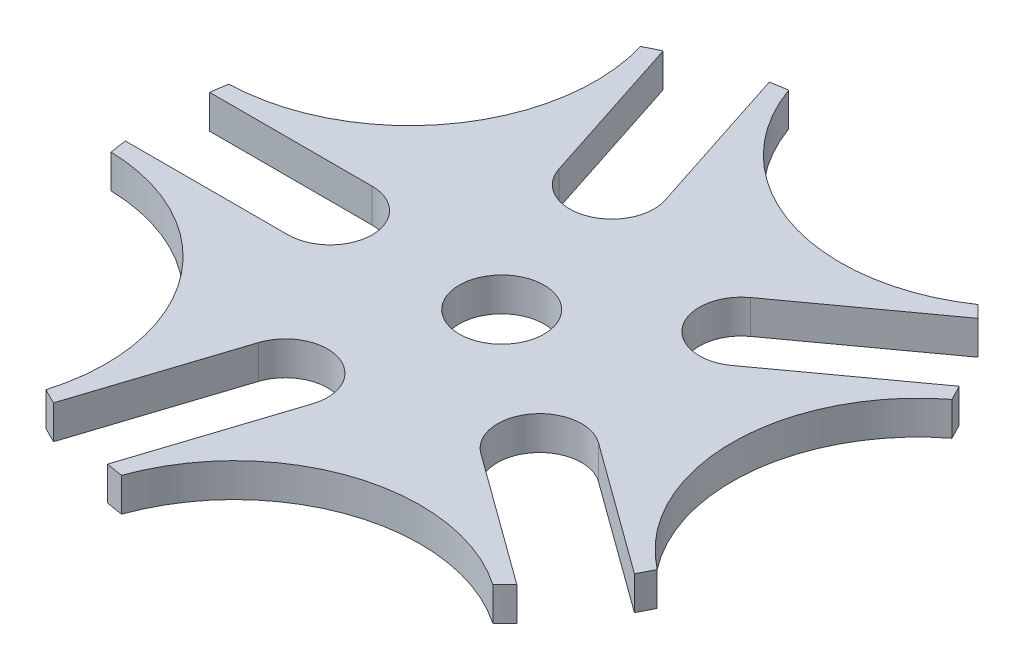
ISO-10303-21;
HEADER;
FILE_DESCRIPTION(('STEP AP214'),'2;1');
FILE_NAME('part.step','',(''),(''),'','','');
FILE_SCHEMA(('AUTOMOTIVE_DESIGN { 1 0 10303 214 1 1 1 1 }'));
ENDSEC;
DATA;
#1=APPLICATION_CONTEXT('core data for automotive mechanical design processes');
#2=APPLICATION_PROTOCOL_DEFINITION('international standard','automotive_design',2000,#1);
#3=PRODUCT_CONTEXT('',#1,'mechanical');
#4=PRODUCT('Part','Part','',(#3));
#5=PRODUCT_RELATED_PRODUCT_CATEGORY('part','',(#4));
#6=PRODUCT_DEFINITION_FORMATION('','',#4);
#7=PRODUCT_DEFINITION_CONTEXT('part definition',#1,'design');
#8=PRODUCT_DEFINITION('design','',#6,#7);
#9=PRODUCT_DEFINITION_SHAPE('','',#8);
#10=(LENGTH_UNIT() NAMED_UNIT(*) SI_UNIT(.MILLI.,.METRE.));
#11=(NAMED_UNIT(*) PLANE_ANGLE_UNIT() SI_UNIT($,.RADIAN.));
#12=(NAMED_UNIT(*) SI_UNIT($,.STERADIAN.) SOLID_ANGLE_UNIT());
#13=UNCERTAINTY_MEASURE_WITH_UNIT(LENGTH_MEASURE(1.E-05),#10,'distance_accuracy_value','');
#14=(GEOMETRIC_REPRESENTATION_CONTEXT(3) GLOBAL_UNCERTAINTY_ASSIGNED_CONTEXT((#13)) GLOBAL_UNIT_ASSIGNED_CONTEXT((#10,
#11,#12)) REPRESENTATION_CONTEXT('',''));
#15=CARTESIAN_POINT('',(0.,0.,0.));
#16=DIRECTION('',(0.,0.,1.));
#17=DIRECTION('',(1.,0.,0.));
#18=AXIS2_PLACEMENT_3D('',#15,#16,#17);
#19=CARTESIAN_POINT('',(0.,2.54,0.));
#20=DIRECTION('',(0.,-1.,0.));
#21=DIRECTION('',(0.,0.,-1.));
#22=AXIS2_PLACEMENT_3D('',#19,#20,#21);
#23=CYLINDRICAL_SURFACE('',#22,25.4);
#24=DIRECTION('',(0.,-1.,0.));
#25=VECTOR('',#24,1.);
#26=CARTESIAN_POINT('',(-11.9486583663731,5.08,-22.4140483457051));
#27=LINE('',#26,#25);
#28=CARTESIAN_POINT('',(-11.9486583663731,2.54,-22.4140483457051));
#29=VERTEX_POINT('',#28);
#30=CARTESIAN_POINT('',(-11.948658366374,0.,-22.4140483457068));
#31=VERTEX_POINT('',#30);
#32=EDGE_CURVE('E50',#29,#31,#27,.T.);
#33=ORIENTED_EDGE('',*,*,#32,.F.);
#34=CARTESIAN_POINT('',(0.,2.54,0.));
#35=DIRECTION('',(0.,1.,0.));
#36=DIRECTION('',(0.,0.,1.));
#37=AXIS2_PLACEMENT_3D('',#34,#35,#36);
#38=CIRCLE('',#37,25.4);
#39=CARTESIAN_POINT('',(-10.8070741132714,2.54,-22.9862382548833));
#40=VERTEX_POINT('',#39);
#41=EDGE_CURVE('E338',#40,#29,#38,.T.);
#42=ORIENTED_EDGE('',*,*,#41,.F.);
#43=DIRECTION('',(0.,-1.,0.));
#44=VECTOR('',#43,1.);
#45=CARTESIAN_POINT('',(-10.8070741132714,2.54,-22.9862382548833));
#46=LINE('',#45,#44);
#47=CARTESIAN_POINT('',(-10.8070741132714,0.,-22.9862382548833));
#48=VERTEX_POINT('',#47);
#49=EDGE_CURVE('E277',#48,#40,#46,.F.);
#50=ORIENTED_EDGE('',*,*,#49,.F.);
#51=CARTESIAN_POINT('',(0.,0.,0.));
#52=DIRECTION('',(0.,1.,0.));
#53=DIRECTION('',(0.,0.,1.));
#54=AXIS2_PLACEMENT_3D('',#51,#52,#53);
#55=CIRCLE('',#54,25.4);
#56=EDGE_CURVE('E257',#48,#31,#55,.T.);
#57=ORIENTED_EDGE('',*,*,#56,.T.);
#58=EDGE_LOOP('',(#33,#42,#50,#57));
#59=FACE_BOUND('',#58,.T.);
#60=ADVANCED_FACE('F37',(#59),#23,.T.);
#61=DIRECTION('',(0.,-1.,0.));
#62=VECTOR('',#61,1.);
#63=CARTESIAN_POINT('',(-25.0093652309289,5.08,-4.43752754875682));
#64=LINE('',#63,#62);
#65=CARTESIAN_POINT('',(-25.0093652309289,2.54,-4.43752754875682));
#66=VERTEX_POINT('',#65);
#67=CARTESIAN_POINT('',(-25.0093652309289,0.,-4.43752754875682));
#68=VERTEX_POINT('',#67);
#69=EDGE_CURVE('E299',#66,#68,#64,.T.);
#70=ORIENTED_EDGE('',*,*,#69,.T.);
#71=CARTESIAN_POINT('',(-25.2007812378906,0.,-3.17499999999725));
#72=VERTEX_POINT('',#71);
#73=EDGE_CURVE('E263',#68,#72,#55,.T.);
#74=ORIENTED_EDGE('',*,*,#73,.T.);
#75=DIRECTION('',(0.,-1.,0.));
#76=VECTOR('',#75,1.);
#77=CARTESIAN_POINT('',(-25.2007812378906,2.54,-3.17499999999725));
#78=LINE('',#77,#76);
#79=CARTESIAN_POINT('',(-25.2007812378906,2.54,-3.17499999999725));
#80=VERTEX_POINT('',#79);
#81=EDGE_CURVE('E298',#80,#72,#78,.T.);
#82=ORIENTED_EDGE('',*,*,#81,.F.);
#83=EDGE_CURVE('E345',#66,#80,#38,.T.);
#84=ORIENTED_EDGE('',*,*,#83,.F.);
#85=EDGE_LOOP('',(#70,#74,#82,#84));
#86=FACE_BOUND('',#85,.T.);
#87=ADVANCED_FACE('F296',(#86),#23,.T.);
#88=DIRECTION('',(0.,-1.,0.));
#89=VECTOR('',#88,1.);
#90=CARTESIAN_POINT('',(17.624688240549,5.08,-18.2901712518881));
#91=LINE('',#90,#89);
#92=CARTESIAN_POINT('',(17.624688240549,2.54,-18.2901712518881));
#93=VERTEX_POINT('',#92);
#94=CARTESIAN_POINT('',(17.6246882405498,0.,-18.290171251889));
#95=VERTEX_POINT('',#94);
#96=EDGE_CURVE('E237',#93,#95,#91,.T.);
#97=ORIENTED_EDGE('',*,*,#96,.F.);
#98=CARTESIAN_POINT('',(18.52164211695,2.54,-17.3812765150211));
#99=VERTEX_POINT('',#98);
#100=EDGE_CURVE('E350',#99,#93,#38,.T.);
#101=ORIENTED_EDGE('',*,*,#100,.F.);
#102=DIRECTION('',(0.,-1.,0.));
#103=VECTOR('',#102,1.);
#104=CARTESIAN_POINT('',(18.52164211695,2.54,-17.3812765150211));
#105=LINE('',#104,#103);
#106=CARTESIAN_POINT('',(18.52164211695,0.,-17.3812765150211));
#107=VERTEX_POINT('',#106);
#108=EDGE_CURVE('E392',#107,#99,#105,.F.);
#109=ORIENTED_EDGE('',*,*,#108,.F.);
#110=EDGE_CURVE('E256',#107,#95,#55,.T.);
#111=ORIENTED_EDGE('',*,*,#110,.T.);
#112=EDGE_LOOP('',(#97,#101,#109,#111));
#113=FACE_BOUND('',#112,.T.);
#114=ADVANCED_FACE('F502',(#113),#23,.T.);
#115=DIRECTION('',(0.,-1.,0.));
#116=VECTOR('',#115,1.);
#117=CARTESIAN_POINT('',(-3.50797938340129,5.08,-25.156591196853));
#118=LINE('',#117,#116);
#119=CARTESIAN_POINT('',(-3.50797938340129,2.54,-25.156591196853));
#120=VERTEX_POINT('',#119);
#121=CARTESIAN_POINT('',(-3.50797938340129,0.,-25.156591196853));
#122=VERTEX_POINT('',#121);
#123=EDGE_CURVE('E234',#120,#122,#118,.T.);
#124=ORIENTED_EDGE('',*,*,#123,.T.);
#125=CARTESIAN_POINT('',(-4.76786523479726,0.,-24.9484961691644));
#126=VERTEX_POINT('',#125);
#127=EDGE_CURVE('E248',#122,#126,#55,.T.);
#128=ORIENTED_EDGE('',*,*,#127,.T.);
#129=DIRECTION('',(0.,-1.,0.));
#130=VECTOR('',#129,1.);
#131=CARTESIAN_POINT('',(-4.76786523479726,2.54,-24.9484961691644));
#132=LINE('',#131,#130);
#133=CARTESIAN_POINT('',(-4.76786523479726,2.54,-24.9484961691644));
#134=VERTEX_POINT('',#133);
#135=EDGE_CURVE('E284',#134,#126,#132,.T.);
#136=ORIENTED_EDGE('',*,*,#135,.F.);
#137=EDGE_CURVE('E250',#120,#134,#38,.T.);
#138=ORIENTED_EDGE('',*,*,#137,.F.);
#139=EDGE_LOOP('',(#124,#128,#136,#138));
#140=FACE_BOUND('',#139,.T.);
#141=ADVANCED_FACE('F246',(#140),#23,.T.);
#142=DIRECTION('',(0.,-1.,0.));
#143=VECTOR('',#142,1.);
#144=CARTESIAN_POINT('',(-25.0093652309277,5.08,4.43752754876034));
#145=LINE('',#144,#143);
#146=CARTESIAN_POINT('',(-25.0093652309277,2.54,4.43752754876034));
#147=VERTEX_POINT('',#146);
#148=CARTESIAN_POINT('',(-25.0093652309288,0.,4.43752754876053));
#149=VERTEX_POINT('',#148);
#150=EDGE_CURVE('E58',#147,#149,#145,.T.);
#151=ORIENTED_EDGE('',*,*,#150,.F.);
#152=CARTESIAN_POINT('',(-25.2007812378899,2.54,3.17500000000277));
#153=VERTEX_POINT('',#152);
#154=EDGE_CURVE('E348',#153,#147,#38,.T.);
#155=ORIENTED_EDGE('',*,*,#154,.F.);
#156=DIRECTION('',(0.,-1.,0.));
#157=VECTOR('',#156,1.);
#158=CARTESIAN_POINT('',(-25.2007812378899,2.54,3.17500000000277));
#159=LINE('',#158,#157);
#160=CARTESIAN_POINT('',(-25.2007812378899,0.,3.17500000000277));
#161=VERTEX_POINT('',#160);
#162=EDGE_CURVE('E309',#161,#153,#159,.F.);
#163=ORIENTED_EDGE('',*,*,#162,.F.);
#164=EDGE_CURVE('E259',#161,#149,#55,.T.);
#165=ORIENTED_EDGE('',*,*,#164,.T.);
#166=EDGE_LOOP('',(#151,#155,#163,#165));
#167=FACE_BOUND('',#166,.T.);
#168=ADVANCED_FACE('F510',(#167),#23,.T.);
#169=DIRECTION('',(0.,-1.,0.));
#170=VECTOR('',#169,1.);
#171=CARTESIAN_POINT('',(-11.948658366372,5.08,22.4140483457086));
#172=LINE('',#171,#170);
#173=CARTESIAN_POINT('',(-11.948658366372,2.54,22.4140483457086));
#174=VERTEX_POINT('',#173);
#175=CARTESIAN_POINT('',(-11.948658366372,0.,22.4140483457086));
#176=VERTEX_POINT('',#175);
#177=EDGE_CURVE('E456',#174,#176,#172,.T.);
#178=ORIENTED_EDGE('',*,*,#177,.T.);
#179=CARTESIAN_POINT('',(-10.807074113268,0.,22.9862382548849));
#180=VERTEX_POINT('',#179);
#181=EDGE_CURVE('E268',#176,#180,#55,.T.);
#182=ORIENTED_EDGE('',*,*,#181,.T.);
#183=DIRECTION('',(0.,-1.,0.));
#184=VECTOR('',#183,1.);
#185=CARTESIAN_POINT('',(-10.807074113268,2.54,22.9862382548849));
#186=LINE('',#185,#184);
#187=CARTESIAN_POINT('',(-10.807074113268,2.54,22.9862382548849));
#188=VERTEX_POINT('',#187);
#189=EDGE_CURVE('E386',#188,#180,#186,.T.);
#190=ORIENTED_EDGE('',*,*,#189,.F.);
#191=EDGE_CURVE('E349',#174,#188,#38,.T.);
#192=ORIENTED_EDGE('',*,*,#191,.F.);
#193=EDGE_LOOP('',(#178,#182,#190,#192));
#194=FACE_BOUND('',#193,.T.);
#195=ADVANCED_FACE('F788',(#194),#23,.T.);
#196=DIRECTION('',(0.,-1.,0.));
#197=VECTOR('',#196,1.);
#198=CARTESIAN_POINT('',(-3.50797938339943,5.08,25.1565911968543));
#199=LINE('',#198,#197);
#200=CARTESIAN_POINT('',(-3.50797938339943,2.54,25.1565911968543));
#201=VERTEX_POINT('',#200);
#202=CARTESIAN_POINT('',(-3.50797938339942,0.,25.1565911968543));
#203=VERTEX_POINT('',#202);
#204=EDGE_CURVE('E461',#201,#203,#199,.T.);
#205=ORIENTED_EDGE('',*,*,#204,.F.);
#206=CARTESIAN_POINT('',(-4.76786523479357,2.54,24.9484961691651));
#207=VERTEX_POINT('',#206);
#208=EDGE_CURVE('E352',#207,#201,#38,.T.);
#209=ORIENTED_EDGE('',*,*,#208,.F.);
#210=DIRECTION('',(0.,-1.,0.));
#211=VECTOR('',#210,1.);
#212=CARTESIAN_POINT('',(-4.76786523479356,2.54,24.9484961691651));
#213=LINE('',#212,#211);
#214=CARTESIAN_POINT('',(-4.76786523479356,0.,24.9484961691651));
#215=VERTEX_POINT('',#214);
#216=EDGE_CURVE('E310',#215,#207,#213,.F.);
#217=ORIENTED_EDGE('',*,*,#216,.F.);
#218=EDGE_CURVE('E264',#215,#203,#55,.T.);
#219=ORIENTED_EDGE('',*,*,#218,.T.);
#220=EDGE_LOOP('',(#205,#209,#217,#219));
#221=FACE_BOUND('',#220,.T.);
#222=ADVANCED_FACE('F550',(#221),#23,.T.);
#223=DIRECTION('',(0.,-1.,0.));
#224=VECTOR('',#223,1.);
#225=CARTESIAN_POINT('',(17.6246882405508,5.08,18.2901712518894));
#226=LINE('',#225,#224);
#227=CARTESIAN_POINT('',(17.6246882405508,2.54,18.2901712518894));
#228=VERTEX_POINT('',#227);
#229=CARTESIAN_POINT('',(17.6246882405508,0.,18.2901712518894));
#230=VERTEX_POINT('',#229);
#231=EDGE_CURVE('E464',#228,#230,#226,.T.);
#232=ORIENTED_EDGE('',*,*,#231,.T.);
#233=CARTESIAN_POINT('',(18.5216421169506,0.,17.3812765150205));
#234=VERTEX_POINT('',#233);
#235=EDGE_CURVE('E269',#230,#234,#55,.T.);
#236=ORIENTED_EDGE('',*,*,#235,.T.);
#237=DIRECTION('',(0.,-1.,0.));
#238=VECTOR('',#237,1.);
#239=CARTESIAN_POINT('',(18.5216421169506,2.54,17.3812765150205));
#240=LINE('',#239,#238);
#241=CARTESIAN_POINT('',(18.5216421169506,2.54,17.3812765150205));
#242=VERTEX_POINT('',#241);
#243=EDGE_CURVE('E390',#242,#234,#240,.T.);
#244=ORIENTED_EDGE('',*,*,#243,.F.);
#245=EDGE_CURVE('E276',#228,#242,#38,.T.);
#246=ORIENTED_EDGE('',*,*,#245,.F.);
#247=EDGE_LOOP('',(#232,#236,#244,#246));
#248=FACE_BOUND('',#247,.T.);
#249=ADVANCED_FACE('F801',(#248),#23,.T.);
#250=DIRECTION('',(0.,-1.,0.));
#251=VECTOR('',#250,1.);
#252=CARTESIAN_POINT('',(22.8413147401536,5.08,11.1101008519834));
#253=LINE('',#252,#251);
#254=CARTESIAN_POINT('',(22.8413147401536,2.54,11.1101008519834));
#255=VERTEX_POINT('',#254);
#256=CARTESIAN_POINT('',(22.8413147401536,0.,11.1101008519834));
#257=VERTEX_POINT('',#256);
#258=EDGE_CURVE('E242',#255,#257,#253,.T.);
#259=ORIENTED_EDGE('',*,*,#258,.F.);
#260=CARTESIAN_POINT('',(22.2540784690076,2.54,12.2440186007394));
#261=VERTEX_POINT('',#260);
#262=EDGE_CURVE('E358',#261,#255,#38,.T.);
#263=ORIENTED_EDGE('',*,*,#262,.F.);
#264=DIRECTION('',(0.,-1.,0.));
#265=VECTOR('',#264,1.);
#266=CARTESIAN_POINT('',(22.2540784690076,2.54,12.2440186007394));
#267=LINE('',#266,#265);
#268=CARTESIAN_POINT('',(22.2540784690076,0.,12.2440186007394));
#269=VERTEX_POINT('',#268);
#270=EDGE_CURVE('E388',#269,#261,#267,.F.);
#271=ORIENTED_EDGE('',*,*,#270,.F.);
#272=EDGE_CURVE('E261',#269,#257,#55,.T.);
#273=ORIENTED_EDGE('',*,*,#272,.T.);
#274=EDGE_LOOP('',(#259,#263,#271,#273));
#275=FACE_BOUND('',#274,.T.);
#276=ADVANCED_FACE('F496',(#275),#23,.T.);
#277=DIRECTION('',(0.,-1.,0.));
#278=VECTOR('',#277,1.);
#279=CARTESIAN_POINT('',(22.8413147401536,5.08,-11.1101008519834));
#280=LINE('',#279,#278);
#281=CARTESIAN_POINT('',(22.8413147401536,2.54,-11.1101008519834));
#282=VERTEX_POINT('',#281);
#283=CARTESIAN_POINT('',(22.8413147401536,0.,-11.1101008519834));
#284=VERTEX_POINT('',#283);
#285=EDGE_CURVE('E469',#282,#284,#280,.T.);
#286=ORIENTED_EDGE('',*,*,#285,.T.);
#287=CARTESIAN_POINT('',(22.2540784690072,0.,-12.2440186007401));
#288=VERTEX_POINT('',#287);
#289=EDGE_CURVE('E260',#284,#288,#55,.T.);
#290=ORIENTED_EDGE('',*,*,#289,.T.);
#291=DIRECTION('',(0.,-1.,0.));
#292=VECTOR('',#291,1.);
#293=CARTESIAN_POINT('',(22.2540784690072,2.54,-12.2440186007401));
#294=LINE('',#293,#292);
#295=CARTESIAN_POINT('',(22.2540784690072,2.54,-12.2440186007401));
#296=VERTEX_POINT('',#295);
#297=EDGE_CURVE('E394',#296,#288,#294,.T.);
#298=ORIENTED_EDGE('',*,*,#297,.F.);
#299=EDGE_CURVE('E359',#282,#296,#38,.T.);
#300=ORIENTED_EDGE('',*,*,#299,.F.);
#301=EDGE_LOOP('',(#286,#290,#298,#300));
#302=FACE_BOUND('',#301,.T.);
#303=ADVANCED_FACE('F489',(#302),#23,.T.);
#304=CARTESIAN_POINT('',(0.,2.54,0.));
#305=DIRECTION('',(0.,1.,0.));
#306=DIRECTION('',(0.,0.,1.));
#307=AXIS2_PLACEMENT_3D('',#304,#305,#306);
#308=PLANE('',#307);
#309=CARTESIAN_POINT('',(0.,2.54,0.));
#310=DIRECTION('',(0.,1.,0.));
#311=DIRECTION('',(0.,0.,1.));
#312=AXIS2_PLACEMENT_3D('',#309,#310,#311);
#313=CIRCLE('',#312,3.2004);
#314=CARTESIAN_POINT('',(0.,2.54,3.2004));
#315=VERTEX_POINT('',#314);
#316=EDGE_CURVE('E475',#315,#315,#313,.T.);
#317=ORIENTED_EDGE('',*,*,#316,.F.);
#318=EDGE_LOOP('',(#317));
#319=FACE_BOUND('',#318,.T.);
#320=ORIENTED_EDGE('',*,*,#41,.T.);
#321=CARTESIAN_POINT('',(-25.3999999999996,2.54,-18.454180211334));
#322=DIRECTION('',(0.,1.,0.));
#323=DIRECTION('',(0.,0.,1.));
#324=AXIS2_PLACEMENT_3D('',#321,#322,#323);
#325=CIRCLE('',#324,14.0220949713707);
#326=EDGE_CURVE('E341',#29,#66,#325,.F.);
#327=ORIENTED_EDGE('',*,*,#326,.T.);
#328=ORIENTED_EDGE('',*,*,#83,.T.);
#329=DIRECTION('',(-1.,0.,0.));
#330=VECTOR('',#329,1.);
#331=CARTESIAN_POINT('',(-25.3999999999991,2.54,-3.17499999999725));
#332=LINE('',#331,#330);
#333=CARTESIAN_POINT('',(-12.9419464171576,2.54,-3.17499999999718));
#334=VERTEX_POINT('',#333);
#335=EDGE_CURVE('E308',#334,#80,#332,.T.);
#336=ORIENTED_EDGE('',*,*,#335,.F.);
#337=CARTESIAN_POINT('',(-12.9419464171576,2.54,2.82828573063649E-12));
#338=DIRECTION('',(0.,1.,0.));
#339=DIRECTION('',(0.,0.,1.));
#340=AXIS2_PLACEMENT_3D('',#337,#338,#339);
#341=CIRCLE('',#340,3.17500000000001);
#342=CARTESIAN_POINT('',(-12.9419464171577,2.54,3.17500000000284));
#343=VERTEX_POINT('',#342);
#344=EDGE_CURVE('E418',#343,#334,#341,.T.);
#345=ORIENTED_EDGE('',*,*,#344,.F.);
#346=DIRECTION('',(1.,0.,0.));
#347=VECTOR('',#346,1.);
#348=CARTESIAN_POINT('',(-25.3999999999991,2.54,3.17500000000277));
#349=LINE('',#348,#347);
#350=EDGE_CURVE('E415',#153,#343,#349,.T.);
#351=ORIENTED_EDGE('',*,*,#350,.F.);
#352=ORIENTED_EDGE('',*,*,#154,.T.);
#353=CARTESIAN_POINT('',(-25.3999999999984,2.54,18.4541802113375));
#354=DIRECTION('',(0.,1.,0.));
#355=DIRECTION('',(0.,0.,1.));
#356=AXIS2_PLACEMENT_3D('',#353,#354,#355);
#357=CIRCLE('',#356,14.0220949713707);
#358=EDGE_CURVE('E452',#147,#174,#357,.F.);
#359=ORIENTED_EDGE('',*,*,#358,.T.);
#360=ORIENTED_EDGE('',*,*,#191,.T.);
#361=DIRECTION('',(-0.309016994374953,0.,0.951056516295152));
#362=VECTOR('',#361,1.);
#363=CARTESIAN_POINT('',(-10.8686360963585,2.54,23.1757065567582));
#364=LINE('',#363,#362);
#365=CARTESIAN_POINT('',(-7.01888582242669,2.54,11.3273935164427));
#366=VERTEX_POINT('',#365);
#367=EDGE_CURVE('E430',#366,#188,#364,.T.);
#368=ORIENTED_EDGE('',*,*,#367,.F.);
#369=CARTESIAN_POINT('',(-3.99928138318958,2.54,12.3085224735831));
#370=DIRECTION('',(0.,1.,0.));
#371=DIRECTION('',(0.,0.,1.));
#372=AXIS2_PLACEMENT_3D('',#369,#370,#371);
#373=CIRCLE('',#372,3.17500000000001);
#374=CARTESIAN_POINT('',(-0.979676943952459,2.54,13.2896514307236));
#375=VERTEX_POINT('',#374);
#376=EDGE_CURVE('E428',#375,#366,#373,.T.);
#377=ORIENTED_EDGE('',*,*,#376,.F.);
#378=DIRECTION('',(0.309016994374953,0.,-0.951056516295152));
#379=VECTOR('',#378,1.);
#380=CARTESIAN_POINT('',(-4.82942721788424,2.54,25.1379644710391));
#381=LINE('',#380,#379);
#382=EDGE_CURVE('E425',#207,#375,#381,.T.);
#383=ORIENTED_EDGE('',*,*,#382,.F.);
#384=ORIENTED_EDGE('',*,*,#208,.T.);
#385=CARTESIAN_POINT('',(9.70193668575385,2.54,29.8594908164577));
#386=DIRECTION('',(0.,1.,0.));
#387=DIRECTION('',(0.,0.,1.));
#388=AXIS2_PLACEMENT_3D('',#385,#386,#387);
#389=CIRCLE('',#388,14.0220949713707);
#390=EDGE_CURVE('E450',#201,#228,#389,.F.);
#391=ORIENTED_EDGE('',*,*,#390,.T.);
#392=ORIENTED_EDGE('',*,*,#245,.T.);
#393=DIRECTION('',(0.809016994374944,0.,0.587785252292477));
#394=VECTOR('',#393,1.);
#395=CARTESIAN_POINT('',(18.6828134810969,2.54,17.4983743653694));
#396=LINE('',#395,#394);
#397=CARTESIAN_POINT('',(8.60403641574445,2.54,10.1757141971057));
#398=VERTEX_POINT('',#397);
#399=EDGE_CURVE('E440',#398,#242,#396,.T.);
#400=ORIENTED_EDGE('',*,*,#399,.F.);
#401=CARTESIAN_POINT('',(10.4702545917731,2.54,7.60708523996529));
#402=DIRECTION('',(0.,1.,0.));
#403=DIRECTION('',(0.,0.,1.));
#404=AXIS2_PLACEMENT_3D('',#401,#402,#403);
#405=CIRCLE('',#404,3.17500000000001);
#406=CARTESIAN_POINT('',(12.3364727678017,2.54,5.03845628282483));
#407=VERTEX_POINT('',#406);
#408=EDGE_CURVE('E438',#407,#398,#405,.T.);
#409=ORIENTED_EDGE('',*,*,#408,.F.);
#410=DIRECTION('',(-0.809016994374944,0.,-0.587785252292478));
#411=VECTOR('',#410,1.);
#412=CARTESIAN_POINT('',(22.4152498331541,2.54,12.3611164510885));
#413=LINE('',#412,#411);
#414=EDGE_CURVE('E408',#261,#407,#413,.T.);
#415=ORIENTED_EDGE('',*,*,#414,.F.);
#416=ORIENTED_EDGE('',*,*,#262,.T.);
#417=CARTESIAN_POINT('',(31.3961266284945,2.54,0.));
#418=DIRECTION('',(0.,1.,0.));
#419=DIRECTION('',(0.,0.,1.));
#420=AXIS2_PLACEMENT_3D('',#417,#418,#419);
#421=CIRCLE('',#420,14.0220949713707);
#422=EDGE_CURVE('E448',#255,#282,#421,.F.);
#423=ORIENTED_EDGE('',*,*,#422,.T.);
#424=ORIENTED_EDGE('',*,*,#299,.T.);
#425=DIRECTION('',(0.809016994374951,0.,-0.587785252292469));
#426=VECTOR('',#425,1.);
#427=CARTESIAN_POINT('',(22.4152498331523,2.54,-12.3611164510882));
#428=LINE('',#427,#426);
#429=CARTESIAN_POINT('',(12.3364727677999,2.54,-5.03845628282468));
#430=VERTEX_POINT('',#429);
#431=EDGE_CURVE('E402',#430,#296,#428,.T.);
#432=ORIENTED_EDGE('',*,*,#431,.F.);
#433=CARTESIAN_POINT('',(10.4702545917713,2.54,-7.60708523996515));
#434=DIRECTION('',(0.,1.,0.));
#435=DIRECTION('',(0.,0.,1.));
#436=AXIS2_PLACEMENT_3D('',#433,#434,#435);
#437=CIRCLE('',#436,3.17500000000001);
#438=CARTESIAN_POINT('',(8.60403641574269,2.54,-10.1757141971056));
#439=VERTEX_POINT('',#438);
#440=EDGE_CURVE('E404',#439,#430,#437,.T.);
#441=ORIENTED_EDGE('',*,*,#440,.F.);
#442=DIRECTION('',(-0.809016994374951,0.,0.587785252292468));
#443=VECTOR('',#442,1.);
#444=CARTESIAN_POINT('',(18.6828134810952,2.54,-17.4983743653692));
#445=LINE('',#444,#443);
#446=EDGE_CURVE('E406',#99,#439,#445,.T.);
#447=ORIENTED_EDGE('',*,*,#446,.F.);
#448=ORIENTED_EDGE('',*,*,#100,.T.);
#449=CARTESIAN_POINT('',(9.701936685752,2.54,-29.8594908164563));
#450=DIRECTION('',(0.,1.,0.));
#451=DIRECTION('',(0.,0.,1.));
#452=AXIS2_PLACEMENT_3D('',#449,#450,#451);
#453=CIRCLE('',#452,14.0220949713707);
#454=EDGE_CURVE('E346',#93,#120,#453,.F.);
#455=ORIENTED_EDGE('',*,*,#454,.T.);
#456=ORIENTED_EDGE('',*,*,#137,.T.);
#457=DIRECTION('',(-0.309016994374943,0.,-0.951056516295155));
#458=VECTOR('',#457,1.);
#459=CARTESIAN_POINT('',(-4.829427217887,2.54,-25.1379644710356));
#460=LINE('',#459,#458);
#461=CARTESIAN_POINT('',(-0.979676943955354,2.54,-13.28965143072));
#462=VERTEX_POINT('',#461);
#463=EDGE_CURVE('E374',#462,#134,#460,.T.);
#464=ORIENTED_EDGE('',*,*,#463,.F.);
#465=CARTESIAN_POINT('',(-3.99928138319248,2.54,-12.3085224735796));
#466=DIRECTION('',(0.,1.,0.));
#467=DIRECTION('',(0.,0.,1.));
#468=AXIS2_PLACEMENT_3D('',#465,#466,#467);
#469=CIRCLE('',#468,3.17500000000001);
#470=CARTESIAN_POINT('',(-7.01888582242961,2.54,-11.3273935164392));
#471=VERTEX_POINT('',#470);
#472=EDGE_CURVE('E380',#471,#462,#469,.T.);
#473=ORIENTED_EDGE('',*,*,#472,.F.);
#474=DIRECTION('',(0.309016994374942,0.,0.951056516295156));
#475=VECTOR('',#474,1.);
#476=CARTESIAN_POINT('',(-10.8686360963612,2.54,-23.1757065567547));
#477=LINE('',#476,#475);
#478=EDGE_CURVE('E409',#40,#471,#477,.T.);
#479=ORIENTED_EDGE('',*,*,#478,.F.);
#480=EDGE_LOOP('',(#320,#327,#328,#336,#345,#351,#352,#359,#360,#368,#377,#383,#384,#391,#392,
#400,#409,#415,#416,#423,#424,#432,#441,#447,#448,#455,#456,#464,#473,#479));
#481=FACE_BOUND('',#480,.T.);
#482=ADVANCED_FACE('F344',(#319,#481),#308,.T.);
#483=CARTESIAN_POINT('',(0.,0.,0.));
#484=DIRECTION('',(0.,1.,0.));
#485=DIRECTION('',(0.,0.,1.));
#486=AXIS2_PLACEMENT_3D('',#483,#484,#485);
#487=PLANE('',#486);
#488=CARTESIAN_POINT('',(0.,0.,0.));
#489=DIRECTION('',(0.,1.,0.));
#490=DIRECTION('',(0.,0.,1.));
#491=AXIS2_PLACEMENT_3D('',#488,#489,#490);
#492=CIRCLE('',#491,3.2004);
#493=CARTESIAN_POINT('',(0.,0.,3.2004));
#494=VERTEX_POINT('',#493);
#495=EDGE_CURVE('E460',#494,#494,#492,.T.);
#496=ORIENTED_EDGE('',*,*,#495,.T.);
#497=EDGE_LOOP('',(#496));
#498=FACE_BOUND('',#497,.T.);
#499=CARTESIAN_POINT('',(-25.3999999999996,0.,-18.454180211334));
#500=DIRECTION('',(0.,1.,0.));
#501=DIRECTION('',(0.,0.,1.));
#502=AXIS2_PLACEMENT_3D('',#499,#500,#501);
#503=CIRCLE('',#502,14.0220949713707);
#504=EDGE_CURVE('E11',#31,#68,#503,.F.);
#505=ORIENTED_EDGE('',*,*,#504,.F.);
#506=ORIENTED_EDGE('',*,*,#56,.F.);
#507=DIRECTION('',(-0.309016994374942,0.,-0.951056516295155));
#508=VECTOR('',#507,1.);
#509=CARTESIAN_POINT('',(-3.01960443923819,0.,0.981128957140789));
#510=LINE('',#509,#508);
#511=CARTESIAN_POINT('',(-7.01888582242961,0.,-11.3273935164392));
#512=VERTEX_POINT('',#511);
#513=EDGE_CURVE('E44',#512,#48,#510,.T.);
#514=ORIENTED_EDGE('',*,*,#513,.F.);
#515=CARTESIAN_POINT('',(-3.99928138319248,0.,-12.3085224735796));
#516=DIRECTION('',(0.,1.,0.));
#517=DIRECTION('',(0.,0.,1.));
#518=AXIS2_PLACEMENT_3D('',#515,#516,#517);
#519=CIRCLE('',#518,3.17500000000001);
#520=CARTESIAN_POINT('',(-0.979676943955354,0.,-13.28965143072));
#521=VERTEX_POINT('',#520);
#522=EDGE_CURVE('E325',#521,#512,#519,.F.);
#523=ORIENTED_EDGE('',*,*,#522,.F.);
#524=DIRECTION('',(0.309016994374943,0.,0.951056516295155));
#525=VECTOR('',#524,1.);
#526=CARTESIAN_POINT('',(3.01960443923607,0.,-0.981128957140102));
#527=LINE('',#526,#525);
#528=EDGE_CURVE('E255',#126,#521,#527,.T.);
#529=ORIENTED_EDGE('',*,*,#528,.F.);
#530=ORIENTED_EDGE('',*,*,#127,.F.);
#531=CARTESIAN_POINT('',(9.701936685752,0.,-29.8594908164563));
#532=DIRECTION('',(0.,1.,0.));
#533=DIRECTION('',(0.,0.,1.));
#534=AXIS2_PLACEMENT_3D('',#531,#532,#533);
#535=CIRCLE('',#534,14.0220949713707);
#536=EDGE_CURVE('E231',#122,#95,#535,.T.);
#537=ORIENTED_EDGE('',*,*,#536,.T.);
#538=ORIENTED_EDGE('',*,*,#110,.F.);
#539=DIRECTION('',(0.809016994374951,0.,-0.587785252292468));
#540=VECTOR('',#539,1.);
#541=CARTESIAN_POINT('',(-1.86621817602859,0.,-2.56862895714047));
#542=LINE('',#541,#540);
#543=CARTESIAN_POINT('',(8.60403641574269,0.,-10.1757141971056));
#544=VERTEX_POINT('',#543);
#545=EDGE_CURVE('E524',#544,#107,#542,.T.);
#546=ORIENTED_EDGE('',*,*,#545,.F.);
#547=CARTESIAN_POINT('',(10.4702545917713,0.,-7.60708523996515));
#548=DIRECTION('',(0.,1.,0.));
#549=DIRECTION('',(0.,0.,1.));
#550=AXIS2_PLACEMENT_3D('',#547,#548,#549);
#551=CIRCLE('',#550,3.17500000000001);
#552=CARTESIAN_POINT('',(12.3364727677999,0.,-5.03845628282468));
#553=VERTEX_POINT('',#552);
#554=EDGE_CURVE('E522',#553,#544,#551,.F.);
#555=ORIENTED_EDGE('',*,*,#554,.F.);
#556=DIRECTION('',(-0.809016994374951,0.,0.587785252292469));
#557=VECTOR('',#556,1.);
#558=CARTESIAN_POINT('',(1.8662181760286,0.,2.56862895714048));
#559=LINE('',#558,#557);
#560=EDGE_CURVE('E369',#288,#553,#559,.T.);
#561=ORIENTED_EDGE('',*,*,#560,.F.);
#562=ORIENTED_EDGE('',*,*,#289,.F.);
#563=CARTESIAN_POINT('',(31.3961266284945,0.,0.));
#564=DIRECTION('',(0.,1.,0.));
#565=DIRECTION('',(0.,0.,1.));
#566=AXIS2_PLACEMENT_3D('',#563,#564,#565);
#567=CIRCLE('',#566,14.0220949713707);
#568=EDGE_CURVE('E463',#284,#257,#567,.T.);
#569=ORIENTED_EDGE('',*,*,#568,.T.);
#570=ORIENTED_EDGE('',*,*,#272,.F.);
#571=DIRECTION('',(0.809016994374944,0.,0.587785252292478));
#572=VECTOR('',#571,1.);
#573=CARTESIAN_POINT('',(1.86621817602927,0.,-2.56862895714134));
#574=LINE('',#573,#572);
#575=CARTESIAN_POINT('',(12.3364727678017,0.,5.03845628282483));
#576=VERTEX_POINT('',#575);
#577=EDGE_CURVE('E532',#576,#269,#574,.T.);
#578=ORIENTED_EDGE('',*,*,#577,.F.);
#579=CARTESIAN_POINT('',(10.4702545917731,0.,7.60708523996529));
#580=DIRECTION('',(0.,1.,0.));
#581=DIRECTION('',(0.,0.,1.));
#582=AXIS2_PLACEMENT_3D('',#579,#580,#581);
#583=CIRCLE('',#582,3.17500000000001);
#584=CARTESIAN_POINT('',(8.60403641574445,0.,10.1757141971057));
#585=VERTEX_POINT('',#584);
#586=EDGE_CURVE('E530',#585,#576,#583,.F.);
#587=ORIENTED_EDGE('',*,*,#586,.F.);
#588=DIRECTION('',(-0.809016994374944,0.,-0.587785252292477));
#589=VECTOR('',#588,1.);
#590=CARTESIAN_POINT('',(-1.86621817602798,0.,2.56862895713957));
#591=LINE('',#590,#589);
#592=EDGE_CURVE('E526',#234,#585,#591,.T.);
#593=ORIENTED_EDGE('',*,*,#592,.F.);
#594=ORIENTED_EDGE('',*,*,#235,.F.);
#595=CARTESIAN_POINT('',(9.70193668575385,0.,29.8594908164577));
#596=DIRECTION('',(0.,1.,0.));
#597=DIRECTION('',(0.,0.,1.));
#598=AXIS2_PLACEMENT_3D('',#595,#596,#597);
#599=CIRCLE('',#598,14.0220949713707);
#600=EDGE_CURVE('E455',#230,#203,#599,.T.);
#601=ORIENTED_EDGE('',*,*,#600,.T.);
#602=ORIENTED_EDGE('',*,*,#218,.F.);
#603=DIRECTION('',(-0.309016994374953,0.,0.951056516295152));
#604=VECTOR('',#603,1.);
#605=CARTESIAN_POINT('',(3.01960443923986,0.,0.98112895714137));
#606=LINE('',#605,#604);
#607=CARTESIAN_POINT('',(-0.979676943952459,0.,13.2896514307236));
#608=VERTEX_POINT('',#607);
#609=EDGE_CURVE('E315',#608,#215,#606,.T.);
#610=ORIENTED_EDGE('',*,*,#609,.F.);
#611=CARTESIAN_POINT('',(-3.99928138318958,0.,12.3085224735831));
#612=DIRECTION('',(0.,1.,0.));
#613=DIRECTION('',(0.,0.,1.));
#614=AXIS2_PLACEMENT_3D('',#611,#612,#613);
#615=CIRCLE('',#614,3.17500000000001);
#616=CARTESIAN_POINT('',(-7.01888582242669,0.,11.3273935164427));
#617=VERTEX_POINT('',#616);
#618=EDGE_CURVE('E319',#617,#608,#615,.F.);
#619=ORIENTED_EDGE('',*,*,#618,.F.);
#620=DIRECTION('',(0.309016994374953,0.,-0.951056516295152));
#621=VECTOR('',#620,1.);
#622=CARTESIAN_POINT('',(-3.01960443923437,0.,-0.981128957139584));
#623=LINE('',#622,#621);
#624=EDGE_CURVE('E534',#180,#617,#623,.T.);
#625=ORIENTED_EDGE('',*,*,#624,.F.);
#626=ORIENTED_EDGE('',*,*,#181,.F.);
#627=CARTESIAN_POINT('',(-25.3999999999984,0.,18.4541802113375));
#628=DIRECTION('',(0.,1.,0.));
#629=DIRECTION('',(0.,0.,1.));
#630=AXIS2_PLACEMENT_3D('',#627,#628,#629);
#631=CIRCLE('',#630,14.0220949713707);
#632=EDGE_CURVE('E458',#176,#149,#631,.T.);
#633=ORIENTED_EDGE('',*,*,#632,.T.);
#634=ORIENTED_EDGE('',*,*,#164,.F.);
#635=DIRECTION('',(-1.,0.,0.));
#636=VECTOR('',#635,1.);
#637=CARTESIAN_POINT('',(0.,0.,3.17500000000291));
#638=LINE('',#637,#636);
#639=CARTESIAN_POINT('',(-12.9419464171577,0.,3.17500000000284));
#640=VERTEX_POINT('',#639);
#641=EDGE_CURVE('E317',#640,#161,#638,.T.);
#642=ORIENTED_EDGE('',*,*,#641,.F.);
#643=CARTESIAN_POINT('',(-12.9419464171576,0.,2.82828573063649E-12));
#644=DIRECTION('',(0.,1.,0.));
#645=DIRECTION('',(0.,0.,1.));
#646=AXIS2_PLACEMENT_3D('',#643,#644,#645);
#647=CIRCLE('',#646,3.17500000000001);
#648=CARTESIAN_POINT('',(-12.9419464171576,0.,-3.17499999999718));
#649=VERTEX_POINT('',#648);
#650=EDGE_CURVE('E314',#649,#640,#647,.F.);
#651=ORIENTED_EDGE('',*,*,#650,.F.);
#652=DIRECTION('',(1.,0.,0.));
#653=VECTOR('',#652,1.);
#654=CARTESIAN_POINT('',(0.,0.,-3.17499999999711));
#655=LINE('',#654,#653);
#656=EDGE_CURVE('E305',#72,#649,#655,.T.);
#657=ORIENTED_EDGE('',*,*,#656,.F.);
#658=ORIENTED_EDGE('',*,*,#73,.F.);
#659=EDGE_LOOP('',(#505,#506,#514,#523,#529,#530,#537,#538,#546,#555,#561,#562,#569,#570,#578,
#587,#593,#594,#601,#602,#610,#619,#625,#626,#633,#634,#642,#651,#657,#658));
#660=FACE_BOUND('',#659,.T.);
#661=ADVANCED_FACE('F253',(#498,#660),#487,.F.);
#662=CARTESIAN_POINT('',(18.6828134810952,2.54,-17.4983743653692));
#663=DIRECTION('',(0.587785252292468,0.,0.809016994374951));
#664=DIRECTION('',(0.809016994374951,0.,-0.587785252292468));
#665=AXIS2_PLACEMENT_3D('',#662,#663,#664);
#666=PLANE('',#665);
#667=ORIENTED_EDGE('',*,*,#108,.T.);
#668=ORIENTED_EDGE('',*,*,#446,.T.);
#669=DIRECTION('',(0.,-1.,0.));
#670=VECTOR('',#669,1.);
#671=CARTESIAN_POINT('',(8.60403641574269,2.54,-10.1757141971056));
#672=LINE('',#671,#670);
#673=EDGE_CURVE('E396',#439,#544,#672,.T.);
#674=ORIENTED_EDGE('',*,*,#673,.T.);
#675=ORIENTED_EDGE('',*,*,#545,.T.);
#676=EDGE_LOOP('',(#667,#668,#674,#675));
#677=FACE_BOUND('',#676,.T.);
#678=ADVANCED_FACE('F495',(#677),#666,.T.);
#679=CARTESIAN_POINT('',(10.4702545917713,2.54,-7.60708523996515));
#680=DIRECTION('',(0.,-1.,0.));
#681=DIRECTION('',(0.,0.,-1.));
#682=AXIS2_PLACEMENT_3D('',#679,#680,#681);
#683=CYLINDRICAL_SURFACE('',#682,3.17500000000001);
#684=ORIENTED_EDGE('',*,*,#554,.T.);
#685=ORIENTED_EDGE('',*,*,#673,.F.);
#686=ORIENTED_EDGE('',*,*,#440,.T.);
#687=DIRECTION('',(0.,-1.,0.));
#688=VECTOR('',#687,1.);
#689=CARTESIAN_POINT('',(12.3364727677999,2.54,-5.03845628282468));
#690=LINE('',#689,#688);
#691=EDGE_CURVE('E399',#430,#553,#690,.T.);
#692=ORIENTED_EDGE('',*,*,#691,.T.);
#693=EDGE_LOOP('',(#684,#685,#686,#692));
#694=FACE_BOUND('',#693,.T.);
#695=ADVANCED_FACE('F519',(#694),#683,.F.);
#696=CARTESIAN_POINT('',(22.4152498331523,2.54,-12.3611164510882));
#697=DIRECTION('',(-0.587785252292469,0.,-0.809016994374951));
#698=DIRECTION('',(-0.809016994374951,0.,0.587785252292469));
#699=AXIS2_PLACEMENT_3D('',#696,#697,#698);
#700=PLANE('',#699);
#701=ORIENTED_EDGE('',*,*,#297,.T.);
#702=ORIENTED_EDGE('',*,*,#560,.T.);
#703=ORIENTED_EDGE('',*,*,#691,.F.);
#704=ORIENTED_EDGE('',*,*,#431,.T.);
#705=EDGE_LOOP('',(#701,#702,#703,#704));
#706=FACE_BOUND('',#705,.T.);
#707=ADVANCED_FACE('F584',(#706),#700,.T.);
#708=CARTESIAN_POINT('',(22.4152498331541,2.54,12.3611164510885));
#709=DIRECTION('',(-0.587785252292478,0.,0.809016994374944));
#710=DIRECTION('',(0.809016994374944,0.,0.587785252292478));
#711=AXIS2_PLACEMENT_3D('',#708,#709,#710);
#712=PLANE('',#711);
#713=ORIENTED_EDGE('',*,*,#270,.T.);
#714=ORIENTED_EDGE('',*,*,#414,.T.);
#715=DIRECTION('',(0.,-1.,0.));
#716=VECTOR('',#715,1.);
#717=CARTESIAN_POINT('',(12.3364727678017,2.54,5.03845628282483));
#718=LINE('',#717,#716);
#719=EDGE_CURVE('E427',#407,#576,#718,.T.);
#720=ORIENTED_EDGE('',*,*,#719,.T.);
#721=ORIENTED_EDGE('',*,*,#577,.T.);
#722=EDGE_LOOP('',(#713,#714,#720,#721));
#723=FACE_BOUND('',#722,.T.);
#724=ADVANCED_FACE('F587',(#723),#712,.T.);
#725=CARTESIAN_POINT('',(10.4702545917731,2.54,7.60708523996529));
#726=DIRECTION('',(0.,-1.,0.));
#727=DIRECTION('',(0.,0.,-1.));
#728=AXIS2_PLACEMENT_3D('',#725,#726,#727);
#729=CYLINDRICAL_SURFACE('',#728,3.17500000000001);
#730=ORIENTED_EDGE('',*,*,#586,.T.);
#731=ORIENTED_EDGE('',*,*,#719,.F.);
#732=ORIENTED_EDGE('',*,*,#408,.T.);
#733=DIRECTION('',(0.,-1.,0.));
#734=VECTOR('',#733,1.);
#735=CARTESIAN_POINT('',(8.60403641574445,2.54,10.1757141971057));
#736=LINE('',#735,#734);
#737=EDGE_CURVE('E442',#398,#585,#736,.T.);
#738=ORIENTED_EDGE('',*,*,#737,.T.);
#739=EDGE_LOOP('',(#730,#731,#732,#738));
#740=FACE_BOUND('',#739,.T.);
#741=ADVANCED_FACE('F613',(#740),#729,.F.);
#742=CARTESIAN_POINT('',(18.6828134810969,2.54,17.4983743653694));
#743=DIRECTION('',(0.587785252292477,0.,-0.809016994374944));
#744=DIRECTION('',(-0.809016994374944,0.,-0.587785252292477));
#745=AXIS2_PLACEMENT_3D('',#742,#743,#744);
#746=PLANE('',#745);
#747=ORIENTED_EDGE('',*,*,#243,.T.);
#748=ORIENTED_EDGE('',*,*,#592,.T.);
#749=ORIENTED_EDGE('',*,*,#737,.F.);
#750=ORIENTED_EDGE('',*,*,#399,.T.);
#751=EDGE_LOOP('',(#747,#748,#749,#750));
#752=FACE_BOUND('',#751,.T.);
#753=ADVANCED_FACE('F622',(#752),#746,.T.);
#754=CARTESIAN_POINT('',(-4.82942721788424,2.54,25.1379644710391));
#755=DIRECTION('',(-0.951056516295152,0.,-0.309016994374953));
#756=DIRECTION('',(-0.309016994374953,0.,0.951056516295152));
#757=AXIS2_PLACEMENT_3D('',#754,#755,#756);
#758=PLANE('',#757);
#759=ORIENTED_EDGE('',*,*,#216,.T.);
#760=ORIENTED_EDGE('',*,*,#382,.T.);
#761=DIRECTION('',(0.,-1.,0.));
#762=VECTOR('',#761,1.);
#763=CARTESIAN_POINT('',(-0.979676943952459,2.54,13.2896514307236));
#764=LINE('',#763,#762);
#765=EDGE_CURVE('E417',#375,#608,#764,.T.);
#766=ORIENTED_EDGE('',*,*,#765,.T.);
#767=ORIENTED_EDGE('',*,*,#609,.T.);
#768=EDGE_LOOP('',(#759,#760,#766,#767));
#769=FACE_BOUND('',#768,.T.);
#770=ADVANCED_FACE('F544',(#769),#758,.T.);
#771=CARTESIAN_POINT('',(-3.99928138318958,2.54,12.3085224735831));
#772=DIRECTION('',(0.,-1.,0.));
#773=DIRECTION('',(0.,0.,-1.));
#774=AXIS2_PLACEMENT_3D('',#771,#772,#773);
#775=CYLINDRICAL_SURFACE('',#774,3.17500000000001);
#776=ORIENTED_EDGE('',*,*,#618,.T.);
#777=ORIENTED_EDGE('',*,*,#765,.F.);
#778=ORIENTED_EDGE('',*,*,#376,.T.);
#779=DIRECTION('',(0.,-1.,0.));
#780=VECTOR('',#779,1.);
#781=CARTESIAN_POINT('',(-7.01888582242669,2.54,11.3273935164427));
#782=LINE('',#781,#780);
#783=EDGE_CURVE('E432',#366,#617,#782,.T.);
#784=ORIENTED_EDGE('',*,*,#783,.T.);
#785=EDGE_LOOP('',(#776,#777,#778,#784));
#786=FACE_BOUND('',#785,.T.);
#787=ADVANCED_FACE('F538',(#786),#775,.F.);
#788=CARTESIAN_POINT('',(-10.8686360963585,2.54,23.1757065567582));
#789=DIRECTION('',(0.951056516295152,0.,0.309016994374952));
#790=DIRECTION('',(0.309016994374953,0.,-0.951056516295152));
#791=AXIS2_PLACEMENT_3D('',#788,#789,#790);
#792=PLANE('',#791);
#793=ORIENTED_EDGE('',*,*,#189,.T.);
#794=ORIENTED_EDGE('',*,*,#624,.T.);
#795=ORIENTED_EDGE('',*,*,#783,.F.);
#796=ORIENTED_EDGE('',*,*,#367,.T.);
#797=EDGE_LOOP('',(#793,#794,#795,#796));
#798=FACE_BOUND('',#797,.T.);
#799=ADVANCED_FACE('F553',(#798),#792,.T.);
#800=CARTESIAN_POINT('',(-25.3999999999991,2.54,3.17500000000277));
#801=DIRECTION('',(0.,0.,-1.));
#802=DIRECTION('',(-1.,0.,0.));
#803=AXIS2_PLACEMENT_3D('',#800,#801,#802);
#804=PLANE('',#803);
#805=ORIENTED_EDGE('',*,*,#162,.T.);
#806=ORIENTED_EDGE('',*,*,#350,.T.);
#807=DIRECTION('',(0.,-1.,0.));
#808=VECTOR('',#807,1.);
#809=CARTESIAN_POINT('',(-12.9419464171577,2.54,3.17500000000284));
#810=LINE('',#809,#808);
#811=EDGE_CURVE('E411',#343,#640,#810,.T.);
#812=ORIENTED_EDGE('',*,*,#811,.T.);
#813=ORIENTED_EDGE('',*,*,#641,.T.);
#814=EDGE_LOOP('',(#805,#806,#812,#813));
#815=FACE_BOUND('',#814,.T.);
#816=ADVANCED_FACE('F560',(#815),#804,.T.);
#817=CARTESIAN_POINT('',(-12.9419464171576,2.54,2.82828573063649E-12));
#818=DIRECTION('',(0.,-1.,0.));
#819=DIRECTION('',(0.,0.,-1.));
#820=AXIS2_PLACEMENT_3D('',#817,#818,#819);
#821=CYLINDRICAL_SURFACE('',#820,3.17500000000001);
#822=ORIENTED_EDGE('',*,*,#650,.T.);
#823=ORIENTED_EDGE('',*,*,#811,.F.);
#824=ORIENTED_EDGE('',*,*,#344,.T.);
#825=DIRECTION('',(0.,-1.,0.));
#826=VECTOR('',#825,1.);
#827=CARTESIAN_POINT('',(-12.9419464171576,2.54,-3.17499999999718));
#828=LINE('',#827,#826);
#829=EDGE_CURVE('E421',#334,#649,#828,.T.);
#830=ORIENTED_EDGE('',*,*,#829,.T.);
#831=EDGE_LOOP('',(#822,#823,#824,#830));
#832=FACE_BOUND('',#831,.T.);
#833=ADVANCED_FACE('F564',(#832),#821,.F.);
#834=CARTESIAN_POINT('',(-25.3999999999991,2.54,-3.17499999999725));
#835=DIRECTION('',(0.,0.,1.));
#836=DIRECTION('',(1.,0.,0.));
#837=AXIS2_PLACEMENT_3D('',#834,#835,#836);
#838=PLANE('',#837);
#839=ORIENTED_EDGE('',*,*,#81,.T.);
#840=ORIENTED_EDGE('',*,*,#656,.T.);
#841=ORIENTED_EDGE('',*,*,#829,.F.);
#842=ORIENTED_EDGE('',*,*,#335,.T.);
#843=EDGE_LOOP('',(#839,#840,#841,#842));
#844=FACE_BOUND('',#843,.T.);
#845=ADVANCED_FACE('F303',(#844),#838,.T.);
#846=CARTESIAN_POINT('',(-10.8686360963612,2.54,-23.1757065567547));
#847=DIRECTION('',(0.951056516295155,0.,-0.309016994374942));
#848=DIRECTION('',(-0.309016994374942,0.,-0.951056516295155));
#849=AXIS2_PLACEMENT_3D('',#846,#847,#848);
#850=PLANE('',#849);
#851=ORIENTED_EDGE('',*,*,#49,.T.);
#852=ORIENTED_EDGE('',*,*,#478,.T.);
#853=DIRECTION('',(0.,-1.,0.));
#854=VECTOR('',#853,1.);
#855=CARTESIAN_POINT('',(-7.01888582242961,2.54,-11.3273935164392));
#856=LINE('',#855,#854);
#857=EDGE_CURVE('E333',#471,#512,#856,.T.);
#858=ORIENTED_EDGE('',*,*,#857,.T.);
#859=ORIENTED_EDGE('',*,*,#513,.T.);
#860=EDGE_LOOP('',(#851,#852,#858,#859));
#861=FACE_BOUND('',#860,.T.);
#862=ADVANCED_FACE('F330',(#861),#850,.T.);
#863=CARTESIAN_POINT('',(-3.99928138319248,2.54,-12.3085224735796));
#864=DIRECTION('',(0.,-1.,0.));
#865=DIRECTION('',(0.,0.,-1.));
#866=AXIS2_PLACEMENT_3D('',#863,#864,#865);
#867=CYLINDRICAL_SURFACE('',#866,3.17500000000001);
#868=ORIENTED_EDGE('',*,*,#522,.T.);
#869=ORIENTED_EDGE('',*,*,#857,.F.);
#870=ORIENTED_EDGE('',*,*,#472,.T.);
#871=DIRECTION('',(0.,-1.,0.));
#872=VECTOR('',#871,1.);
#873=CARTESIAN_POINT('',(-0.979676943955354,2.54,-13.28965143072));
#874=LINE('',#873,#872);
#875=EDGE_CURVE('E379',#462,#521,#874,.T.);
#876=ORIENTED_EDGE('',*,*,#875,.T.);
#877=EDGE_LOOP('',(#868,#869,#870,#876));
#878=FACE_BOUND('',#877,.T.);
#879=ADVANCED_FACE('F577',(#878),#867,.F.);
#880=CARTESIAN_POINT('',(-4.829427217887,2.54,-25.1379644710356));
#881=DIRECTION('',(-0.951056516295155,0.,0.309016994374943));
#882=DIRECTION('',(0.309016994374943,0.,0.951056516295155));
#883=AXIS2_PLACEMENT_3D('',#880,#881,#882);
#884=PLANE('',#883);
#885=ORIENTED_EDGE('',*,*,#135,.T.);
#886=ORIENTED_EDGE('',*,*,#528,.T.);
#887=ORIENTED_EDGE('',*,*,#875,.F.);
#888=ORIENTED_EDGE('',*,*,#463,.T.);
#889=EDGE_LOOP('',(#885,#886,#887,#888));
#890=FACE_BOUND('',#889,.T.);
#891=ADVANCED_FACE('F377',(#890),#884,.T.);
#892=CARTESIAN_POINT('',(-25.3999999999984,5.08,18.4541802113375));
#893=DIRECTION('',(0.,-1.,0.));
#894=DIRECTION('',(0.,0.,-1.));
#895=AXIS2_PLACEMENT_3D('',#892,#893,#894);
#896=CYLINDRICAL_SURFACE('',#895,14.0220949713707);
#897=ORIENTED_EDGE('',*,*,#150,.T.);
#898=ORIENTED_EDGE('',*,*,#632,.F.);
#899=ORIENTED_EDGE('',*,*,#177,.F.);
#900=ORIENTED_EDGE('',*,*,#358,.F.);
#901=EDGE_LOOP('',(#897,#898,#899,#900));
#902=FACE_BOUND('',#901,.T.);
#903=ADVANCED_FACE('F583',(#902),#896,.F.);
#904=CARTESIAN_POINT('',(9.70193668575385,5.08,29.8594908164577));
#905=DIRECTION('',(0.,-1.,0.));
#906=DIRECTION('',(0.,0.,-1.));
#907=AXIS2_PLACEMENT_3D('',#904,#905,#906);
#908=CYLINDRICAL_SURFACE('',#907,14.0220949713707);
#909=ORIENTED_EDGE('',*,*,#204,.T.);
#910=ORIENTED_EDGE('',*,*,#600,.F.);
#911=ORIENTED_EDGE('',*,*,#231,.F.);
#912=ORIENTED_EDGE('',*,*,#390,.F.);
#913=EDGE_LOOP('',(#909,#910,#911,#912));
#914=FACE_BOUND('',#913,.T.);
#915=ADVANCED_FACE('F703',(#914),#908,.F.);
#916=CARTESIAN_POINT('',(31.3961266284945,5.08,0.));
#917=DIRECTION('',(0.,-1.,0.));
#918=DIRECTION('',(0.,0.,-1.));
#919=AXIS2_PLACEMENT_3D('',#916,#917,#918);
#920=CYLINDRICAL_SURFACE('',#919,14.0220949713707);
#921=ORIENTED_EDGE('',*,*,#258,.T.);
#922=ORIENTED_EDGE('',*,*,#568,.F.);
#923=ORIENTED_EDGE('',*,*,#285,.F.);
#924=ORIENTED_EDGE('',*,*,#422,.F.);
#925=EDGE_LOOP('',(#921,#922,#923,#924));
#926=FACE_BOUND('',#925,.T.);
#927=ADVANCED_FACE('F713',(#926),#920,.F.);
#928=CARTESIAN_POINT('',(9.701936685752,5.08,-29.8594908164563));
#929=DIRECTION('',(0.,-1.,0.));
#930=DIRECTION('',(0.,0.,-1.));
#931=AXIS2_PLACEMENT_3D('',#928,#929,#930);
#932=CYLINDRICAL_SURFACE('',#931,14.0220949713707);
#933=ORIENTED_EDGE('',*,*,#96,.T.);
#934=ORIENTED_EDGE('',*,*,#536,.F.);
#935=ORIENTED_EDGE('',*,*,#123,.F.);
#936=ORIENTED_EDGE('',*,*,#454,.F.);
#937=EDGE_LOOP('',(#933,#934,#935,#936));
#938=FACE_BOUND('',#937,.T.);
#939=ADVANCED_FACE('F233',(#938),#932,.F.);
#940=CARTESIAN_POINT('',(-25.3999999999996,5.08,-18.454180211334));
#941=DIRECTION('',(0.,-1.,0.));
#942=DIRECTION('',(0.,0.,-1.));
#943=AXIS2_PLACEMENT_3D('',#940,#941,#942);
#944=CYLINDRICAL_SURFACE('',#943,14.0220949713707);
#945=ORIENTED_EDGE('',*,*,#32,.T.);
#946=ORIENTED_EDGE('',*,*,#504,.T.);
#947=ORIENTED_EDGE('',*,*,#69,.F.);
#948=ORIENTED_EDGE('',*,*,#326,.F.);
#949=EDGE_LOOP('',(#945,#946,#947,#948));
#950=FACE_BOUND('',#949,.T.);
#951=ADVANCED_FACE('F339',(#950),#944,.F.);
#952=CARTESIAN_POINT('',(0.,0.,0.));
#953=DIRECTION('',(0.,1.,0.));
#954=DIRECTION('',(0.,0.,1.));
#955=AXIS2_PLACEMENT_3D('',#952,#953,#954);
#956=CYLINDRICAL_SURFACE('',#955,3.2004);
#957=ORIENTED_EDGE('',*,*,#495,.F.);
#958=EDGE_LOOP('',(#957));
#959=FACE_BOUND('',#958,.T.);
#960=ORIENTED_EDGE('',*,*,#316,.T.);
#961=EDGE_LOOP('',(#960));
#962=FACE_BOUND('',#961,.T.);
#963=ADVANCED_FACE('F482',(#959,#962),#956,.F.);
#964=CLOSED_SHELL('',(#60,#87,#114,#141,#168,#195,#222,#249,#276,#303,#482,#661,#678,#695,#707,
#724,#741,#753,#770,#787,#799,#816,#833,#845,#862,#879,#891,#903,#915,#927,#939,#951,#963));
#965=MANIFOLD_SOLID_BREP('B2',#964);
#966=ADVANCED_BREP_SHAPE_REPRESENTATION('',(#18,#965),#14);
#967=SHAPE_DEFINITION_REPRESENTATION(#9,#966);
ENDSEC;
END-ISO-10303-21;
